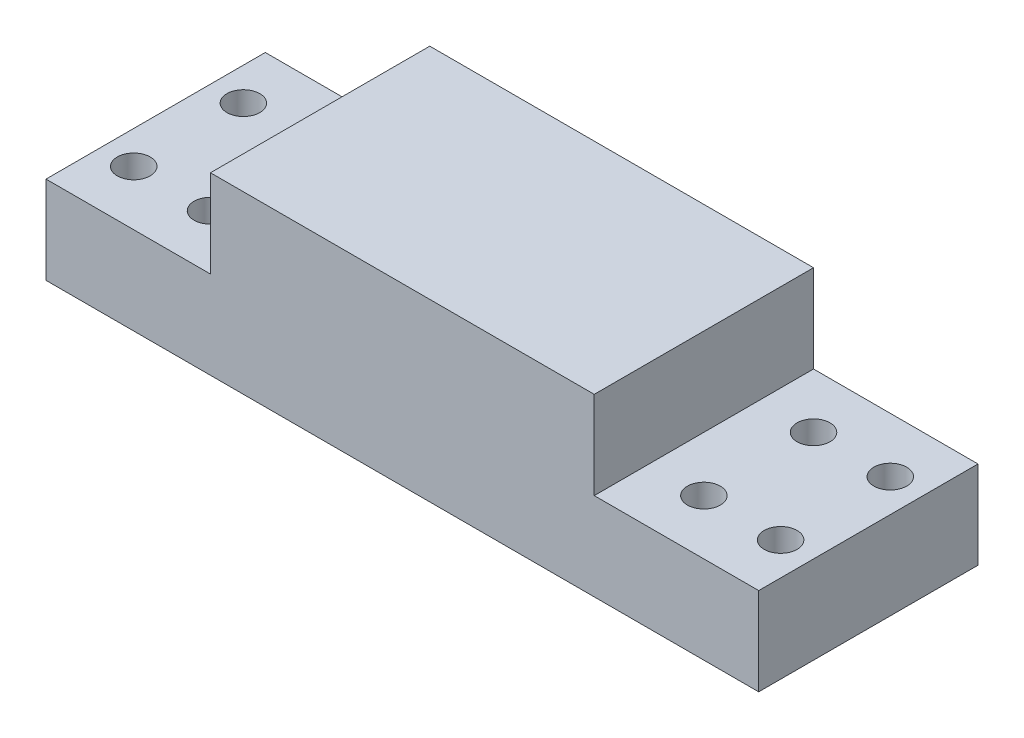
ISO-10303-21;
HEADER;
FILE_DESCRIPTION(('STEP AP214'),'2;1');
FILE_NAME('part.step','',(''),(''),'','','');
FILE_SCHEMA(('AUTOMOTIVE_DESIGN { 1 0 10303 214 1 1 1 1 }'));
ENDSEC;
DATA;
#1=APPLICATION_CONTEXT('core data for automotive mechanical design processes');
#2=APPLICATION_PROTOCOL_DEFINITION('international standard','automotive_design',2000,#1);
#3=PRODUCT_CONTEXT('',#1,'mechanical');
#4=PRODUCT('Part','Part','',(#3));
#5=PRODUCT_RELATED_PRODUCT_CATEGORY('part','',(#4));
#6=PRODUCT_DEFINITION_FORMATION('','',#4);
#7=PRODUCT_DEFINITION_CONTEXT('part definition',#1,'design');
#8=PRODUCT_DEFINITION('design','',#6,#7);
#9=PRODUCT_DEFINITION_SHAPE('','',#8);
#10=(LENGTH_UNIT() NAMED_UNIT(*) SI_UNIT(.MILLI.,.METRE.));
#11=(NAMED_UNIT(*) PLANE_ANGLE_UNIT() SI_UNIT($,.RADIAN.));
#12=(NAMED_UNIT(*) SI_UNIT($,.STERADIAN.) SOLID_ANGLE_UNIT());
#13=UNCERTAINTY_MEASURE_WITH_UNIT(LENGTH_MEASURE(1.E-05),#10,'distance_accuracy_value','');
#14=(GEOMETRIC_REPRESENTATION_CONTEXT(3) GLOBAL_UNCERTAINTY_ASSIGNED_CONTEXT((#13)) GLOBAL_UNIT_ASSIGNED_CONTEXT((#10,
#11,#12)) REPRESENTATION_CONTEXT('',''));
#15=CARTESIAN_POINT('',(0.,0.,0.));
#16=DIRECTION('',(0.,0.,1.));
#17=DIRECTION('',(1.,0.,0.));
#18=AXIS2_PLACEMENT_3D('',#15,#16,#17);
#19=CARTESIAN_POINT('',(17.5,16.,10.));
#20=DIRECTION('',(1.,0.,0.));
#21=DIRECTION('',(0.,0.,-1.));
#22=AXIS2_PLACEMENT_3D('',#19,#20,#21);
#23=PLANE('',#22);
#24=DIRECTION('',(0.,-1.,0.));
#25=VECTOR('',#24,1.);
#26=CARTESIAN_POINT('',(17.5,16.,10.));
#27=LINE('',#26,#25);
#28=CARTESIAN_POINT('',(17.5,16.,10.));
#29=VERTEX_POINT('',#28);
#30=CARTESIAN_POINT('',(17.5,8.,10.));
#31=VERTEX_POINT('',#30);
#32=EDGE_CURVE('E128',#29,#31,#27,.T.);
#33=ORIENTED_EDGE('',*,*,#32,.T.);
#34=DIRECTION('',(0.,0.,-1.));
#35=VECTOR('',#34,1.);
#36=CARTESIAN_POINT('',(17.5,8.,0.));
#37=LINE('',#36,#35);
#38=CARTESIAN_POINT('',(17.5,8.,-10.));
#39=VERTEX_POINT('',#38);
#40=EDGE_CURVE('E114',#31,#39,#37,.T.);
#41=ORIENTED_EDGE('',*,*,#40,.T.);
#42=DIRECTION('',(0.,-1.,0.));
#43=VECTOR('',#42,1.);
#44=CARTESIAN_POINT('',(17.5,16.,-10.));
#45=LINE('',#44,#43);
#46=CARTESIAN_POINT('',(17.5,16.,-10.));
#47=VERTEX_POINT('',#46);
#48=EDGE_CURVE('E184',#47,#39,#45,.T.);
#49=ORIENTED_EDGE('',*,*,#48,.F.);
#50=DIRECTION('',(0.,0.,1.));
#51=VECTOR('',#50,1.);
#52=CARTESIAN_POINT('',(17.5,16.,10.));
#53=LINE('',#52,#51);
#54=EDGE_CURVE('E137',#47,#29,#53,.T.);
#55=ORIENTED_EDGE('',*,*,#54,.T.);
#56=EDGE_LOOP('',(#33,#41,#49,#55));
#57=FACE_BOUND('',#56,.T.);
#58=ADVANCED_FACE('F41',(#57),#23,.T.);
#59=CARTESIAN_POINT('',(0.,8.,10.));
#60=DIRECTION('',(0.,0.,-1.));
#61=DIRECTION('',(-1.,0.,0.));
#62=AXIS2_PLACEMENT_3D('',#59,#60,#61);
#63=PLANE('',#62);
#64=DIRECTION('',(1.,0.,0.));
#65=VECTOR('',#64,1.);
#66=CARTESIAN_POINT('',(0.,0.,10.));
#67=LINE('',#66,#65);
#68=CARTESIAN_POINT('',(-32.5,0.,10.));
#69=VERTEX_POINT('',#68);
#70=CARTESIAN_POINT('',(32.5,0.,10.));
#71=VERTEX_POINT('',#70);
#72=EDGE_CURVE('E196',#69,#71,#67,.T.);
#73=ORIENTED_EDGE('',*,*,#72,.T.);
#74=DIRECTION('',(0.,-1.,0.));
#75=VECTOR('',#74,1.);
#76=CARTESIAN_POINT('',(32.5,8.,10.));
#77=LINE('',#76,#75);
#78=CARTESIAN_POINT('',(32.5,8.,10.));
#79=VERTEX_POINT('',#78);
#80=EDGE_CURVE('E131',#79,#71,#77,.T.);
#81=ORIENTED_EDGE('',*,*,#80,.F.);
#82=DIRECTION('',(-1.,0.,0.));
#83=VECTOR('',#82,1.);
#84=CARTESIAN_POINT('',(0.,8.,10.));
#85=LINE('',#84,#83);
#86=EDGE_CURVE('E118',#79,#31,#85,.T.);
#87=ORIENTED_EDGE('',*,*,#86,.T.);
#88=ORIENTED_EDGE('',*,*,#32,.F.);
#89=DIRECTION('',(-1.,0.,0.));
#90=VECTOR('',#89,1.);
#91=CARTESIAN_POINT('',(-17.5,16.,10.));
#92=LINE('',#91,#90);
#93=CARTESIAN_POINT('',(-17.5,16.,10.));
#94=VERTEX_POINT('',#93);
#95=EDGE_CURVE('E240',#29,#94,#92,.T.);
#96=ORIENTED_EDGE('',*,*,#95,.T.);
#97=DIRECTION('',(0.,-1.,0.));
#98=VECTOR('',#97,1.);
#99=CARTESIAN_POINT('',(-17.5,16.,10.));
#100=LINE('',#99,#98);
#101=CARTESIAN_POINT('',(-17.5,8.,10.));
#102=VERTEX_POINT('',#101);
#103=EDGE_CURVE('E139',#94,#102,#100,.T.);
#104=ORIENTED_EDGE('',*,*,#103,.T.);
#105=DIRECTION('',(1.,0.,0.));
#106=VECTOR('',#105,1.);
#107=CARTESIAN_POINT('',(0.,8.,10.));
#108=LINE('',#107,#106);
#109=CARTESIAN_POINT('',(-32.5,8.,10.));
#110=VERTEX_POINT('',#109);
#111=EDGE_CURVE('E168',#110,#102,#108,.T.);
#112=ORIENTED_EDGE('',*,*,#111,.F.);
#113=DIRECTION('',(0.,-1.,0.));
#114=VECTOR('',#113,1.);
#115=CARTESIAN_POINT('',(-32.5,8.,10.));
#116=LINE('',#115,#114);
#117=EDGE_CURVE('E50',#110,#69,#116,.T.);
#118=ORIENTED_EDGE('',*,*,#117,.T.);
#119=EDGE_LOOP('',(#73,#81,#87,#88,#96,#104,#112,#118));
#120=FACE_BOUND('',#119,.T.);
#121=ADVANCED_FACE('F126',(#120),#63,.F.);
#122=CARTESIAN_POINT('',(0.,8.,-10.));
#123=DIRECTION('',(0.,0.,1.));
#124=DIRECTION('',(1.,0.,0.));
#125=AXIS2_PLACEMENT_3D('',#122,#123,#124);
#126=PLANE('',#125);
#127=DIRECTION('',(-1.,0.,0.));
#128=VECTOR('',#127,1.);
#129=CARTESIAN_POINT('',(0.,0.,-10.));
#130=LINE('',#129,#128);
#131=CARTESIAN_POINT('',(32.5,0.,-10.));
#132=VERTEX_POINT('',#131);
#133=CARTESIAN_POINT('',(-32.5,0.,-10.));
#134=VERTEX_POINT('',#133);
#135=EDGE_CURVE('E199',#132,#134,#130,.T.);
#136=ORIENTED_EDGE('',*,*,#135,.T.);
#137=DIRECTION('',(0.,-1.,0.));
#138=VECTOR('',#137,1.);
#139=CARTESIAN_POINT('',(-32.5,8.,-10.));
#140=LINE('',#139,#138);
#141=CARTESIAN_POINT('',(-32.5,8.,-10.));
#142=VERTEX_POINT('',#141);
#143=EDGE_CURVE('E11',#142,#134,#140,.T.);
#144=ORIENTED_EDGE('',*,*,#143,.F.);
#145=DIRECTION('',(-1.,0.,0.));
#146=VECTOR('',#145,1.);
#147=CARTESIAN_POINT('',(0.,8.,-10.));
#148=LINE('',#147,#146);
#149=CARTESIAN_POINT('',(-17.5,8.,-10.));
#150=VERTEX_POINT('',#149);
#151=EDGE_CURVE('E85',#150,#142,#148,.T.);
#152=ORIENTED_EDGE('',*,*,#151,.F.);
#153=DIRECTION('',(0.,-1.,0.));
#154=VECTOR('',#153,1.);
#155=CARTESIAN_POINT('',(-17.5,16.,-10.));
#156=LINE('',#155,#154);
#157=CARTESIAN_POINT('',(-17.5,16.,-10.));
#158=VERTEX_POINT('',#157);
#159=EDGE_CURVE('E145',#158,#150,#156,.T.);
#160=ORIENTED_EDGE('',*,*,#159,.F.);
#161=DIRECTION('',(1.,0.,0.));
#162=VECTOR('',#161,1.);
#163=CARTESIAN_POINT('',(17.5,16.,-10.));
#164=LINE('',#163,#162);
#165=EDGE_CURVE('E140',#158,#47,#164,.T.);
#166=ORIENTED_EDGE('',*,*,#165,.T.);
#167=ORIENTED_EDGE('',*,*,#48,.T.);
#168=DIRECTION('',(1.,0.,0.));
#169=VECTOR('',#168,1.);
#170=CARTESIAN_POINT('',(0.,8.,-10.));
#171=LINE('',#170,#169);
#172=CARTESIAN_POINT('',(32.5,8.,-10.));
#173=VERTEX_POINT('',#172);
#174=EDGE_CURVE('E57',#39,#173,#171,.T.);
#175=ORIENTED_EDGE('',*,*,#174,.T.);
#176=DIRECTION('',(0.,-1.,0.));
#177=VECTOR('',#176,1.);
#178=CARTESIAN_POINT('',(32.5,8.,-10.));
#179=LINE('',#178,#177);
#180=EDGE_CURVE('E232',#173,#132,#179,.T.);
#181=ORIENTED_EDGE('',*,*,#180,.T.);
#182=EDGE_LOOP('',(#136,#144,#152,#160,#166,#167,#175,#181));
#183=FACE_BOUND('',#182,.T.);
#184=ADVANCED_FACE('F253',(#183),#126,.F.);
#185=CARTESIAN_POINT('',(-22.5,8.,-5.));
#186=DIRECTION('',(0.,-1.,0.));
#187=DIRECTION('',(0.,0.,-1.));
#188=AXIS2_PLACEMENT_3D('',#185,#186,#187);
#189=CYLINDRICAL_SURFACE('',#188,1.5);
#190=CARTESIAN_POINT('',(-22.5,8.,-5.));
#191=DIRECTION('',(0.,1.,0.));
#192=DIRECTION('',(0.,0.,1.));
#193=AXIS2_PLACEMENT_3D('',#190,#191,#192);
#194=CIRCLE('',#193,1.5);
#195=CARTESIAN_POINT('',(-22.5,8.,-3.5));
#196=VERTEX_POINT('',#195);
#197=EDGE_CURVE('E164',#196,#196,#194,.T.);
#198=ORIENTED_EDGE('',*,*,#197,.T.);
#199=EDGE_LOOP('',(#198));
#200=FACE_BOUND('',#199,.T.);
#201=CARTESIAN_POINT('',(-22.5,0.,-5.));
#202=DIRECTION('',(0.,1.,0.));
#203=DIRECTION('',(0.,0.,1.));
#204=AXIS2_PLACEMENT_3D('',#201,#202,#203);
#205=CIRCLE('',#204,1.5);
#206=CARTESIAN_POINT('',(-22.5,0.,-3.5));
#207=VERTEX_POINT('',#206);
#208=EDGE_CURVE('E192',#207,#207,#205,.T.);
#209=ORIENTED_EDGE('',*,*,#208,.F.);
#210=EDGE_LOOP('',(#209));
#211=FACE_BOUND('',#210,.T.);
#212=ADVANCED_FACE('F286',(#200,#211),#189,.F.);
#213=CARTESIAN_POINT('',(-29.5,8.,-5.));
#214=DIRECTION('',(0.,-1.,0.));
#215=DIRECTION('',(0.,0.,-1.));
#216=AXIS2_PLACEMENT_3D('',#213,#214,#215);
#217=CYLINDRICAL_SURFACE('',#216,1.5);
#218=CARTESIAN_POINT('',(-29.5,8.,-5.));
#219=DIRECTION('',(0.,1.,0.));
#220=DIRECTION('',(0.,0.,1.));
#221=AXIS2_PLACEMENT_3D('',#218,#219,#220);
#222=CIRCLE('',#221,1.5);
#223=CARTESIAN_POINT('',(-29.5,8.,-3.5));
#224=VERTEX_POINT('',#223);
#225=EDGE_CURVE('E160',#224,#224,#222,.T.);
#226=ORIENTED_EDGE('',*,*,#225,.T.);
#227=EDGE_LOOP('',(#226));
#228=FACE_BOUND('',#227,.T.);
#229=CARTESIAN_POINT('',(-29.5,0.,-5.));
#230=DIRECTION('',(0.,1.,0.));
#231=DIRECTION('',(0.,0.,1.));
#232=AXIS2_PLACEMENT_3D('',#229,#230,#231);
#233=CIRCLE('',#232,1.5);
#234=CARTESIAN_POINT('',(-29.5,0.,-3.5));
#235=VERTEX_POINT('',#234);
#236=EDGE_CURVE('E188',#235,#235,#233,.T.);
#237=ORIENTED_EDGE('',*,*,#236,.F.);
#238=EDGE_LOOP('',(#237));
#239=FACE_BOUND('',#238,.T.);
#240=ADVANCED_FACE('F290',(#228,#239),#217,.F.);
#241=CARTESIAN_POINT('',(-29.5,8.,5.));
#242=DIRECTION('',(0.,-1.,0.));
#243=DIRECTION('',(0.,0.,-1.));
#244=AXIS2_PLACEMENT_3D('',#241,#242,#243);
#245=CYLINDRICAL_SURFACE('',#244,1.5);
#246=CARTESIAN_POINT('',(-29.5,8.,5.));
#247=DIRECTION('',(0.,1.,0.));
#248=DIRECTION('',(0.,0.,1.));
#249=AXIS2_PLACEMENT_3D('',#246,#247,#248);
#250=CIRCLE('',#249,1.5);
#251=CARTESIAN_POINT('',(-29.5,8.,6.5));
#252=VERTEX_POINT('',#251);
#253=EDGE_CURVE('E156',#252,#252,#250,.T.);
#254=ORIENTED_EDGE('',*,*,#253,.T.);
#255=EDGE_LOOP('',(#254));
#256=FACE_BOUND('',#255,.T.);
#257=CARTESIAN_POINT('',(-29.5,0.,5.));
#258=DIRECTION('',(0.,1.,0.));
#259=DIRECTION('',(0.,0.,1.));
#260=AXIS2_PLACEMENT_3D('',#257,#258,#259);
#261=CIRCLE('',#260,1.5);
#262=CARTESIAN_POINT('',(-29.5,0.,6.5));
#263=VERTEX_POINT('',#262);
#264=EDGE_CURVE('E183',#263,#263,#261,.T.);
#265=ORIENTED_EDGE('',*,*,#264,.F.);
#266=EDGE_LOOP('',(#265));
#267=FACE_BOUND('',#266,.T.);
#268=ADVANCED_FACE('F293',(#256,#267),#245,.F.);
#269=CARTESIAN_POINT('',(-22.5,8.,5.));
#270=DIRECTION('',(0.,-1.,0.));
#271=DIRECTION('',(0.,0.,-1.));
#272=AXIS2_PLACEMENT_3D('',#269,#270,#271);
#273=CYLINDRICAL_SURFACE('',#272,1.5);
#274=CARTESIAN_POINT('',(-22.5,8.,5.));
#275=DIRECTION('',(0.,1.,0.));
#276=DIRECTION('',(0.,0.,1.));
#277=AXIS2_PLACEMENT_3D('',#274,#275,#276);
#278=CIRCLE('',#277,1.5);
#279=CARTESIAN_POINT('',(-22.5,8.,6.5));
#280=VERTEX_POINT('',#279);
#281=EDGE_CURVE('E152',#280,#280,#278,.T.);
#282=ORIENTED_EDGE('',*,*,#281,.T.);
#283=EDGE_LOOP('',(#282));
#284=FACE_BOUND('',#283,.T.);
#285=CARTESIAN_POINT('',(-22.5,0.,5.));
#286=DIRECTION('',(0.,1.,0.));
#287=DIRECTION('',(0.,0.,1.));
#288=AXIS2_PLACEMENT_3D('',#285,#286,#287);
#289=CIRCLE('',#288,1.5);
#290=CARTESIAN_POINT('',(-22.5,0.,6.5));
#291=VERTEX_POINT('',#290);
#292=EDGE_CURVE('E179',#291,#291,#289,.T.);
#293=ORIENTED_EDGE('',*,*,#292,.F.);
#294=EDGE_LOOP('',(#293));
#295=FACE_BOUND('',#294,.T.);
#296=ADVANCED_FACE('F43',(#284,#295),#273,.F.);
#297=CARTESIAN_POINT('',(-32.5,8.,0.));
#298=DIRECTION('',(1.,0.,0.));
#299=DIRECTION('',(0.,0.,-1.));
#300=AXIS2_PLACEMENT_3D('',#297,#298,#299);
#301=PLANE('',#300);
#302=DIRECTION('',(0.,0.,1.));
#303=VECTOR('',#302,1.);
#304=CARTESIAN_POINT('',(-32.5,0.,0.));
#305=LINE('',#304,#303);
#306=EDGE_CURVE('E79',#134,#69,#305,.T.);
#307=ORIENTED_EDGE('',*,*,#306,.T.);
#308=ORIENTED_EDGE('',*,*,#117,.F.);
#309=DIRECTION('',(0.,0.,1.));
#310=VECTOR('',#309,1.);
#311=CARTESIAN_POINT('',(-32.5,8.,0.));
#312=LINE('',#311,#310);
#313=EDGE_CURVE('E66',#142,#110,#312,.T.);
#314=ORIENTED_EDGE('',*,*,#313,.F.);
#315=ORIENTED_EDGE('',*,*,#143,.T.);
#316=EDGE_LOOP('',(#307,#308,#314,#315));
#317=FACE_BOUND('',#316,.T.);
#318=ADVANCED_FACE('F278',(#317),#301,.F.);
#319=CARTESIAN_POINT('',(0.,8.,0.));
#320=DIRECTION('',(0.,1.,0.));
#321=DIRECTION('',(0.,0.,1.));
#322=AXIS2_PLACEMENT_3D('',#319,#320,#321);
#323=PLANE('',#322);
#324=ORIENTED_EDGE('',*,*,#281,.F.);
#325=EDGE_LOOP('',(#324));
#326=FACE_BOUND('',#325,.T.);
#327=ORIENTED_EDGE('',*,*,#253,.F.);
#328=EDGE_LOOP('',(#327));
#329=FACE_BOUND('',#328,.T.);
#330=ORIENTED_EDGE('',*,*,#225,.F.);
#331=EDGE_LOOP('',(#330));
#332=FACE_BOUND('',#331,.T.);
#333=ORIENTED_EDGE('',*,*,#197,.F.);
#334=EDGE_LOOP('',(#333));
#335=FACE_BOUND('',#334,.T.);
#336=ORIENTED_EDGE('',*,*,#111,.T.);
#337=DIRECTION('',(0.,0.,1.));
#338=VECTOR('',#337,1.);
#339=CARTESIAN_POINT('',(-17.5,8.,0.));
#340=LINE('',#339,#338);
#341=EDGE_CURVE('E171',#150,#102,#340,.T.);
#342=ORIENTED_EDGE('',*,*,#341,.F.);
#343=ORIENTED_EDGE('',*,*,#151,.T.);
#344=ORIENTED_EDGE('',*,*,#313,.T.);
#345=EDGE_LOOP('',(#336,#342,#343,#344));
#346=FACE_BOUND('',#345,.T.);
#347=ADVANCED_FACE('F275',(#326,#329,#332,#335,#346),#323,.T.);
#348=CARTESIAN_POINT('',(0.,0.,0.));
#349=DIRECTION('',(0.,1.,0.));
#350=DIRECTION('',(0.,0.,1.));
#351=AXIS2_PLACEMENT_3D('',#348,#349,#350);
#352=PLANE('',#351);
#353=ORIENTED_EDGE('',*,*,#292,.T.);
#354=EDGE_LOOP('',(#353));
#355=FACE_BOUND('',#354,.T.);
#356=ORIENTED_EDGE('',*,*,#264,.T.);
#357=EDGE_LOOP('',(#356));
#358=FACE_BOUND('',#357,.T.);
#359=ORIENTED_EDGE('',*,*,#236,.T.);
#360=EDGE_LOOP('',(#359));
#361=FACE_BOUND('',#360,.T.);
#362=ORIENTED_EDGE('',*,*,#208,.T.);
#363=EDGE_LOOP('',(#362));
#364=FACE_BOUND('',#363,.T.);
#365=ORIENTED_EDGE('',*,*,#72,.F.);
#366=ORIENTED_EDGE('',*,*,#306,.F.);
#367=ORIENTED_EDGE('',*,*,#135,.F.);
#368=DIRECTION('',(0.,0.,1.));
#369=VECTOR('',#368,1.);
#370=CARTESIAN_POINT('',(32.5,0.,0.));
#371=LINE('',#370,#369);
#372=EDGE_CURVE('E211',#132,#71,#371,.T.);
#373=ORIENTED_EDGE('',*,*,#372,.T.);
#374=EDGE_LOOP('',(#365,#366,#367,#373));
#375=FACE_BOUND('',#374,.T.);
#376=CARTESIAN_POINT('',(29.5,0.,-5.));
#377=DIRECTION('',(0.,1.,0.));
#378=DIRECTION('',(0.,0.,1.));
#379=AXIS2_PLACEMENT_3D('',#376,#377,#378);
#380=CIRCLE('',#379,1.5);
#381=CARTESIAN_POINT('',(29.5,0.,-3.5));
#382=VERTEX_POINT('',#381);
#383=EDGE_CURVE('E224',#382,#382,#380,.T.);
#384=ORIENTED_EDGE('',*,*,#383,.T.);
#385=EDGE_LOOP('',(#384));
#386=FACE_BOUND('',#385,.T.);
#387=CARTESIAN_POINT('',(22.5,0.,-5.));
#388=DIRECTION('',(0.,1.,0.));
#389=DIRECTION('',(0.,0.,1.));
#390=AXIS2_PLACEMENT_3D('',#387,#388,#389);
#391=CIRCLE('',#390,1.5);
#392=CARTESIAN_POINT('',(22.5,0.,-3.5));
#393=VERTEX_POINT('',#392);
#394=EDGE_CURVE('E216',#393,#393,#391,.T.);
#395=ORIENTED_EDGE('',*,*,#394,.T.);
#396=EDGE_LOOP('',(#395));
#397=FACE_BOUND('',#396,.T.);
#398=CARTESIAN_POINT('',(29.5,0.,5.));
#399=DIRECTION('',(0.,1.,0.));
#400=DIRECTION('',(0.,0.,1.));
#401=AXIS2_PLACEMENT_3D('',#398,#399,#400);
#402=CIRCLE('',#401,1.5);
#403=CARTESIAN_POINT('',(29.5,0.,6.5));
#404=VERTEX_POINT('',#403);
#405=EDGE_CURVE('E215',#404,#404,#402,.T.);
#406=ORIENTED_EDGE('',*,*,#405,.T.);
#407=EDGE_LOOP('',(#406));
#408=FACE_BOUND('',#407,.T.);
#409=CARTESIAN_POINT('',(22.5,0.,5.));
#410=DIRECTION('',(0.,1.,0.));
#411=DIRECTION('',(0.,0.,1.));
#412=AXIS2_PLACEMENT_3D('',#409,#410,#411);
#413=CIRCLE('',#412,1.5);
#414=CARTESIAN_POINT('',(22.5,0.,6.5));
#415=VERTEX_POINT('',#414);
#416=EDGE_CURVE('E221',#415,#415,#413,.T.);
#417=ORIENTED_EDGE('',*,*,#416,.T.);
#418=EDGE_LOOP('',(#417));
#419=FACE_BOUND('',#418,.T.);
#420=ADVANCED_FACE('F208',(#355,#358,#361,#364,#375,#386,#397,#408,#419),#352,.F.);
#421=CARTESIAN_POINT('',(-17.5,16.,-10.));
#422=DIRECTION('',(-1.,0.,0.));
#423=DIRECTION('',(0.,0.,1.));
#424=AXIS2_PLACEMENT_3D('',#421,#422,#423);
#425=PLANE('',#424);
#426=ORIENTED_EDGE('',*,*,#159,.T.);
#427=ORIENTED_EDGE('',*,*,#341,.T.);
#428=ORIENTED_EDGE('',*,*,#103,.F.);
#429=DIRECTION('',(0.,0.,-1.));
#430=VECTOR('',#429,1.);
#431=CARTESIAN_POINT('',(-17.5,16.,-10.));
#432=LINE('',#431,#430);
#433=EDGE_CURVE('E148',#94,#158,#432,.T.);
#434=ORIENTED_EDGE('',*,*,#433,.T.);
#435=EDGE_LOOP('',(#426,#427,#428,#434));
#436=FACE_BOUND('',#435,.T.);
#437=ADVANCED_FACE('F250',(#436),#425,.T.);
#438=CARTESIAN_POINT('',(0.,16.,0.));
#439=DIRECTION('',(0.,1.,0.));
#440=DIRECTION('',(0.,0.,1.));
#441=AXIS2_PLACEMENT_3D('',#438,#439,#440);
#442=PLANE('',#441);
#443=ORIENTED_EDGE('',*,*,#54,.F.);
#444=ORIENTED_EDGE('',*,*,#165,.F.);
#445=ORIENTED_EDGE('',*,*,#433,.F.);
#446=ORIENTED_EDGE('',*,*,#95,.F.);
#447=EDGE_LOOP('',(#443,#444,#445,#446));
#448=FACE_BOUND('',#447,.T.);
#449=ADVANCED_FACE('F255',(#448),#442,.T.);
#450=CARTESIAN_POINT('',(29.5,8.,5.));
#451=DIRECTION('',(0.,-1.,0.));
#452=DIRECTION('',(0.,0.,-1.));
#453=AXIS2_PLACEMENT_3D('',#450,#451,#452);
#454=CYLINDRICAL_SURFACE('',#453,1.5);
#455=CARTESIAN_POINT('',(29.5,8.,5.));
#456=DIRECTION('',(0.,1.,0.));
#457=DIRECTION('',(0.,0.,1.));
#458=AXIS2_PLACEMENT_3D('',#455,#456,#457);
#459=CIRCLE('',#458,1.5);
#460=CARTESIAN_POINT('',(29.5,8.,6.5));
#461=VERTEX_POINT('',#460);
#462=EDGE_CURVE('E317',#461,#461,#459,.T.);
#463=ORIENTED_EDGE('',*,*,#462,.T.);
#464=EDGE_LOOP('',(#463));
#465=FACE_BOUND('',#464,.T.);
#466=ORIENTED_EDGE('',*,*,#405,.F.);
#467=EDGE_LOOP('',(#466));
#468=FACE_BOUND('',#467,.T.);
#469=ADVANCED_FACE('F257',(#465,#468),#454,.F.);
#470=CARTESIAN_POINT('',(32.5,8.,0.));
#471=DIRECTION('',(1.,0.,0.));
#472=DIRECTION('',(0.,0.,-1.));
#473=AXIS2_PLACEMENT_3D('',#470,#471,#472);
#474=PLANE('',#473);
#475=ORIENTED_EDGE('',*,*,#372,.F.);
#476=ORIENTED_EDGE('',*,*,#180,.F.);
#477=DIRECTION('',(0.,0.,1.));
#478=VECTOR('',#477,1.);
#479=CARTESIAN_POINT('',(32.5,8.,0.));
#480=LINE('',#479,#478);
#481=EDGE_CURVE('E133',#173,#79,#480,.T.);
#482=ORIENTED_EDGE('',*,*,#481,.T.);
#483=ORIENTED_EDGE('',*,*,#80,.T.);
#484=EDGE_LOOP('',(#475,#476,#482,#483));
#485=FACE_BOUND('',#484,.T.);
#486=ADVANCED_FACE('F263',(#485),#474,.T.);
#487=CARTESIAN_POINT('',(22.5,8.,-5.));
#488=DIRECTION('',(0.,-1.,0.));
#489=DIRECTION('',(0.,0.,-1.));
#490=AXIS2_PLACEMENT_3D('',#487,#488,#489);
#491=CYLINDRICAL_SURFACE('',#490,1.5);
#492=CARTESIAN_POINT('',(22.5,8.,-5.));
#493=DIRECTION('',(0.,1.,0.));
#494=DIRECTION('',(0.,0.,1.));
#495=AXIS2_PLACEMENT_3D('',#492,#493,#494);
#496=CIRCLE('',#495,1.5);
#497=CARTESIAN_POINT('',(22.5,8.,-3.5));
#498=VERTEX_POINT('',#497);
#499=EDGE_CURVE('E355',#498,#498,#496,.T.);
#500=ORIENTED_EDGE('',*,*,#499,.T.);
#501=EDGE_LOOP('',(#500));
#502=FACE_BOUND('',#501,.T.);
#503=ORIENTED_EDGE('',*,*,#394,.F.);
#504=EDGE_LOOP('',(#503));
#505=FACE_BOUND('',#504,.T.);
#506=ADVANCED_FACE('F333',(#502,#505),#491,.F.);
#507=CARTESIAN_POINT('',(29.5,8.,-5.));
#508=DIRECTION('',(0.,-1.,0.));
#509=DIRECTION('',(0.,0.,-1.));
#510=AXIS2_PLACEMENT_3D('',#507,#508,#509);
#511=CYLINDRICAL_SURFACE('',#510,1.5);
#512=CARTESIAN_POINT('',(29.5,8.,-5.));
#513=DIRECTION('',(0.,1.,0.));
#514=DIRECTION('',(0.,0.,1.));
#515=AXIS2_PLACEMENT_3D('',#512,#513,#514);
#516=CIRCLE('',#515,1.5);
#517=CARTESIAN_POINT('',(29.5,8.,-3.5));
#518=VERTEX_POINT('',#517);
#519=EDGE_CURVE('E231',#518,#518,#516,.T.);
#520=ORIENTED_EDGE('',*,*,#519,.T.);
#521=EDGE_LOOP('',(#520));
#522=FACE_BOUND('',#521,.T.);
#523=ORIENTED_EDGE('',*,*,#383,.F.);
#524=EDGE_LOOP('',(#523));
#525=FACE_BOUND('',#524,.T.);
#526=ADVANCED_FACE('F330',(#522,#525),#511,.F.);
#527=CARTESIAN_POINT('',(22.5,8.,5.));
#528=DIRECTION('',(0.,-1.,0.));
#529=DIRECTION('',(0.,0.,-1.));
#530=AXIS2_PLACEMENT_3D('',#527,#528,#529);
#531=CYLINDRICAL_SURFACE('',#530,1.5);
#532=CARTESIAN_POINT('',(22.5,8.,5.));
#533=DIRECTION('',(0.,1.,0.));
#534=DIRECTION('',(0.,0.,1.));
#535=AXIS2_PLACEMENT_3D('',#532,#533,#534);
#536=CIRCLE('',#535,1.5);
#537=CARTESIAN_POINT('',(22.5,8.,6.5));
#538=VERTEX_POINT('',#537);
#539=EDGE_CURVE('E235',#538,#538,#536,.T.);
#540=ORIENTED_EDGE('',*,*,#539,.T.);
#541=EDGE_LOOP('',(#540));
#542=FACE_BOUND('',#541,.T.);
#543=ORIENTED_EDGE('',*,*,#416,.F.);
#544=EDGE_LOOP('',(#543));
#545=FACE_BOUND('',#544,.T.);
#546=ADVANCED_FACE('F332',(#542,#545),#531,.F.);
#547=CARTESIAN_POINT('',(0.,8.,0.));
#548=DIRECTION('',(0.,1.,0.));
#549=DIRECTION('',(0.,0.,1.));
#550=AXIS2_PLACEMENT_3D('',#547,#548,#549);
#551=PLANE('',#550);
#552=ORIENTED_EDGE('',*,*,#519,.F.);
#553=EDGE_LOOP('',(#552));
#554=FACE_BOUND('',#553,.T.);
#555=ORIENTED_EDGE('',*,*,#499,.F.);
#556=EDGE_LOOP('',(#555));
#557=FACE_BOUND('',#556,.T.);
#558=ORIENTED_EDGE('',*,*,#174,.F.);
#559=ORIENTED_EDGE('',*,*,#40,.F.);
#560=ORIENTED_EDGE('',*,*,#86,.F.);
#561=ORIENTED_EDGE('',*,*,#481,.F.);
#562=EDGE_LOOP('',(#558,#559,#560,#561));
#563=FACE_BOUND('',#562,.T.);
#564=ORIENTED_EDGE('',*,*,#462,.F.);
#565=EDGE_LOOP('',(#564));
#566=FACE_BOUND('',#565,.T.);
#567=ORIENTED_EDGE('',*,*,#539,.F.);
#568=EDGE_LOOP('',(#567));
#569=FACE_BOUND('',#568,.T.);
#570=ADVANCED_FACE('F116',(#554,#557,#563,#566,#569),#551,.T.);
#571=CLOSED_SHELL('',(#58,#121,#184,#212,#240,#268,#296,#318,#347,#420,#437,#449,#469,#486,#506,
#526,#546,#570));
#572=MANIFOLD_SOLID_BREP('B2',#571);
#573=ADVANCED_BREP_SHAPE_REPRESENTATION('',(#18,#572),#14);
#574=SHAPE_DEFINITION_REPRESENTATION(#9,#573);
ENDSEC;
END-ISO-10303-21;
